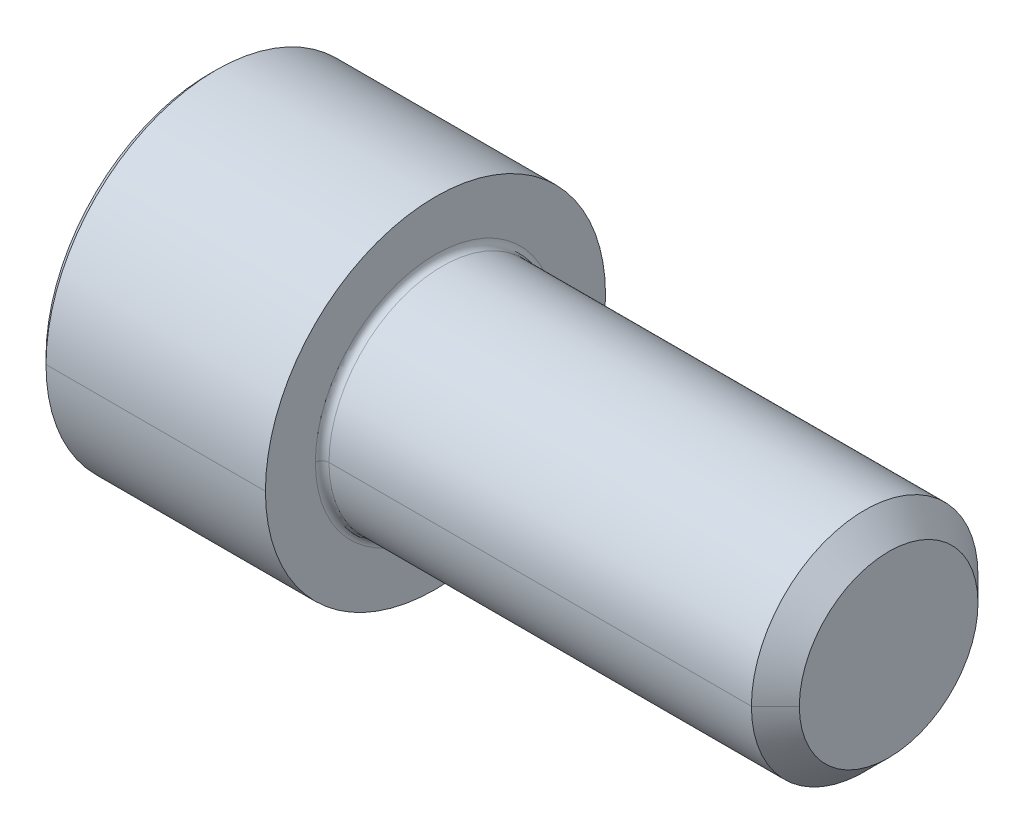
ISO-10303-21;
HEADER;
FILE_DESCRIPTION(('STEP AP214'),'2;1');
FILE_NAME('part.step','',(''),(''),'','','');
FILE_SCHEMA(('AUTOMOTIVE_DESIGN { 1 0 10303 214 1 1 1 1 }'));
ENDSEC;
DATA;
#1=APPLICATION_CONTEXT('core data for automotive mechanical design processes');
#2=APPLICATION_PROTOCOL_DEFINITION('international standard','automotive_design',2000,#1);
#3=PRODUCT_CONTEXT('',#1,'mechanical');
#4=PRODUCT('Part','Part','',(#3));
#5=PRODUCT_RELATED_PRODUCT_CATEGORY('part','',(#4));
#6=PRODUCT_DEFINITION_FORMATION('','',#4);
#7=PRODUCT_DEFINITION_CONTEXT('part definition',#1,'design');
#8=PRODUCT_DEFINITION('design','',#6,#7);
#9=PRODUCT_DEFINITION_SHAPE('','',#8);
#10=(LENGTH_UNIT() NAMED_UNIT(*) SI_UNIT(.MILLI.,.METRE.));
#11=(NAMED_UNIT(*) PLANE_ANGLE_UNIT() SI_UNIT($,.RADIAN.));
#12=(NAMED_UNIT(*) SI_UNIT($,.STERADIAN.) SOLID_ANGLE_UNIT());
#13=UNCERTAINTY_MEASURE_WITH_UNIT(LENGTH_MEASURE(1.E-05),#10,'distance_accuracy_value','');
#14=(GEOMETRIC_REPRESENTATION_CONTEXT(3) GLOBAL_UNCERTAINTY_ASSIGNED_CONTEXT((#13)) GLOBAL_UNIT_ASSIGNED_CONTEXT((#10,
#11,#12)) REPRESENTATION_CONTEXT('',''));
#15=CARTESIAN_POINT('',(0.,0.,0.));
#16=DIRECTION('',(0.,0.,1.));
#17=DIRECTION('',(1.,0.,0.));
#18=AXIS2_PLACEMENT_3D('',#15,#16,#17);
#19=CARTESIAN_POINT('',(-4.0894,0.,0.));
#20=DIRECTION('',(-1.,0.,0.));
#21=DIRECTION('',(0.,1.,0.));
#22=AXIS2_PLACEMENT_3D('',#19,#20,#21);
#23=CONICAL_SURFACE('',#22,3.175,1.04719755119659);
#24=CARTESIAN_POINT('',(-2.25631289532291,0.,0.));
#25=DIRECTION('',(-0.500000000000007,0.,-0.866025403784435));
#26=VECTOR('',#25,1.);
#27=LINE('',#24,#26);
#28=CARTESIAN_POINT('',(-2.2563128953229,0.,0.));
#29=VERTEX_POINT('',#28);
#30=CARTESIAN_POINT('',(-4.0894,0.,-3.175));
#31=VERTEX_POINT('',#30);
#32=EDGE_CURVE('E11',#29,#31,#27,.T.);
#33=ORIENTED_EDGE('',*,*,#32,.T.);
#34=CARTESIAN_POINT('',(-4.0894,0.,0.));
#35=DIRECTION('',(1.,0.,0.));
#36=DIRECTION('',(0.,0.,-1.));
#37=AXIS2_PLACEMENT_3D('',#34,#35,#36);
#38=CIRCLE('',#37,3.175);
#39=CARTESIAN_POINT('',(-4.0894,-2.74963065701562,-1.58749999999996));
#40=VERTEX_POINT('',#39);
#41=EDGE_CURVE('E25',#40,#31,#38,.T.);
#42=ORIENTED_EDGE('',*,*,#41,.F.);
#43=CARTESIAN_POINT('',(-4.0894,0.,0.));
#44=DIRECTION('',(1.,0.,0.));
#45=DIRECTION('',(0.,0.,-1.));
#46=AXIS2_PLACEMENT_3D('',#43,#44,#45);
#47=CIRCLE('',#46,3.175);
#48=CARTESIAN_POINT('',(-4.0894,-2.74963065701562,1.58749999999996));
#49=VERTEX_POINT('',#48);
#50=EDGE_CURVE('E604',#49,#40,#47,.T.);
#51=ORIENTED_EDGE('',*,*,#50,.F.);
#52=CARTESIAN_POINT('',(-4.0894,0.,0.));
#53=DIRECTION('',(1.,0.,0.));
#54=DIRECTION('',(0.,0.,-1.));
#55=AXIS2_PLACEMENT_3D('',#52,#53,#54);
#56=CIRCLE('',#55,3.175);
#57=CARTESIAN_POINT('',(-4.0894,0.,3.175));
#58=VERTEX_POINT('',#57);
#59=EDGE_CURVE('E601',#58,#49,#56,.T.);
#60=ORIENTED_EDGE('',*,*,#59,.F.);
#61=CARTESIAN_POINT('',(-2.25631289532291,0.,0.));
#62=DIRECTION('',(-0.500000000000007,0.,0.866025403784435));
#63=VECTOR('',#62,1.);
#64=LINE('',#61,#63);
#65=EDGE_CURVE('E591',#29,#58,#64,.T.);
#66=ORIENTED_EDGE('',*,*,#65,.F.);
#67=EDGE_LOOP('',(#33,#42,#51,#60,#66));
#68=FACE_BOUND('',#67,.T.);
#69=ADVANCED_FACE('F17',(#68),#23,.F.);
#70=CARTESIAN_POINT('',(-4.0894,0.,0.));
#71=DIRECTION('',(-1.,0.,0.));
#72=DIRECTION('',(0.,-1.,0.));
#73=AXIS2_PLACEMENT_3D('',#70,#71,#72);
#74=CONICAL_SURFACE('',#73,3.175,1.04719755119659);
#75=ORIENTED_EDGE('',*,*,#65,.T.);
#76=CARTESIAN_POINT('',(-4.0894,0.,0.));
#77=DIRECTION('',(1.,0.,0.));
#78=DIRECTION('',(0.,0.,-1.));
#79=AXIS2_PLACEMENT_3D('',#76,#77,#78);
#80=CIRCLE('',#79,3.175);
#81=CARTESIAN_POINT('',(-4.0894,2.74963065701562,1.58749999999996));
#82=VERTEX_POINT('',#81);
#83=EDGE_CURVE('E643',#82,#58,#80,.T.);
#84=ORIENTED_EDGE('',*,*,#83,.F.);
#85=CARTESIAN_POINT('',(-4.0894,0.,0.));
#86=DIRECTION('',(1.,0.,0.));
#87=DIRECTION('',(0.,0.,-1.));
#88=AXIS2_PLACEMENT_3D('',#85,#86,#87);
#89=CIRCLE('',#88,3.175);
#90=CARTESIAN_POINT('',(-4.0894,2.74963065701562,-1.58749999999996));
#91=VERTEX_POINT('',#90);
#92=EDGE_CURVE('E646',#91,#82,#89,.T.);
#93=ORIENTED_EDGE('',*,*,#92,.F.);
#94=CARTESIAN_POINT('',(-4.0894,0.,0.));
#95=DIRECTION('',(1.,0.,0.));
#96=DIRECTION('',(0.,0.,-1.));
#97=AXIS2_PLACEMENT_3D('',#94,#95,#96);
#98=CIRCLE('',#97,3.175);
#99=EDGE_CURVE('E557',#31,#91,#98,.T.);
#100=ORIENTED_EDGE('',*,*,#99,.F.);
#101=ORIENTED_EDGE('',*,*,#32,.F.);
#102=EDGE_LOOP('',(#75,#84,#93,#100,#101));
#103=FACE_BOUND('',#102,.T.);
#104=ADVANCED_FACE('F564',(#103),#74,.F.);
#105=CARTESIAN_POINT('',(-4.0894,0.,0.));
#106=DIRECTION('',(1.,0.,0.));
#107=DIRECTION('',(0.,0.,-1.));
#108=AXIS2_PLACEMENT_3D('',#105,#106,#107);
#109=PLANE('',#108);
#110=ORIENTED_EDGE('',*,*,#99,.T.);
#111=DIRECTION('',(0.,0.499999999999987,0.866025403784446));
#112=VECTOR('',#111,1.);
#113=CARTESIAN_POINT('',(-4.0894,1.8330871046771,-3.175));
#114=LINE('',#113,#112);
#115=CARTESIAN_POINT('',(-4.0894,1.8330871046771,-3.175));
#116=VERTEX_POINT('',#115);
#117=EDGE_CURVE('E552',#116,#91,#114,.T.);
#118=ORIENTED_EDGE('',*,*,#117,.F.);
#119=DIRECTION('',(0.,1.,0.));
#120=VECTOR('',#119,1.);
#121=CARTESIAN_POINT('',(-4.0894,-1.8330871046771,-3.175));
#122=LINE('',#121,#120);
#123=EDGE_CURVE('E547',#31,#116,#122,.T.);
#124=ORIENTED_EDGE('',*,*,#123,.F.);
#125=EDGE_LOOP('',(#110,#118,#124));
#126=FACE_BOUND('',#125,.T.);
#127=ADVANCED_FACE('F573',(#126),#109,.F.);
#128=CARTESIAN_POINT('',(-4.0894,-1.8330871046771,-3.175));
#129=DIRECTION('',(0.,0.,1.));
#130=DIRECTION('',(1.,0.,0.));
#131=AXIS2_PLACEMENT_3D('',#128,#129,#130);
#132=PLANE('',#131);
#133=DIRECTION('',(0.,1.,0.));
#134=VECTOR('',#133,1.);
#135=CARTESIAN_POINT('',(-7.9248,-1.8330871046771,-3.175));
#136=LINE('',#135,#134);
#137=CARTESIAN_POINT('',(-7.9248,-1.8330871046771,-3.175));
#138=VERTEX_POINT('',#137);
#139=CARTESIAN_POINT('',(-7.9248,1.8330871046771,-3.175));
#140=VERTEX_POINT('',#139);
#141=EDGE_CURVE('E542',#138,#140,#136,.T.);
#142=ORIENTED_EDGE('',*,*,#141,.F.);
#143=DIRECTION('',(-1.,0.,0.));
#144=VECTOR('',#143,1.);
#145=CARTESIAN_POINT('',(-4.0894,-1.8330871046771,-3.175));
#146=LINE('',#145,#144);
#147=CARTESIAN_POINT('',(-4.0894,-1.8330871046771,-3.175));
#148=VERTEX_POINT('',#147);
#149=EDGE_CURVE('E537',#148,#138,#146,.T.);
#150=ORIENTED_EDGE('',*,*,#149,.F.);
#151=DIRECTION('',(0.,1.,0.));
#152=VECTOR('',#151,1.);
#153=CARTESIAN_POINT('',(-4.0894,-1.8330871046771,-3.175));
#154=LINE('',#153,#152);
#155=EDGE_CURVE('E532',#148,#31,#154,.T.);
#156=ORIENTED_EDGE('',*,*,#155,.T.);
#157=ORIENTED_EDGE('',*,*,#123,.T.);
#158=DIRECTION('',(-1.,0.,0.));
#159=VECTOR('',#158,1.);
#160=CARTESIAN_POINT('',(-4.0894,1.8330871046771,-3.175));
#161=LINE('',#160,#159);
#162=EDGE_CURVE('E528',#116,#140,#161,.T.);
#163=ORIENTED_EDGE('',*,*,#162,.T.);
#164=EDGE_LOOP('',(#142,#150,#156,#157,#163));
#165=FACE_BOUND('',#164,.T.);
#166=ADVANCED_FACE('F672',(#165),#132,.T.);
#167=CARTESIAN_POINT('',(-4.0894,1.8330871046771,-3.175));
#168=DIRECTION('',(0.,-0.866025403784446,0.499999999999987));
#169=DIRECTION('',(0.,-0.499999999999987,-0.866025403784446));
#170=AXIS2_PLACEMENT_3D('',#167,#168,#169);
#171=PLANE('',#170);
#172=DIRECTION('',(0.,0.499999999999987,0.866025403784446));
#173=VECTOR('',#172,1.);
#174=CARTESIAN_POINT('',(-7.9248,1.8330871046771,-3.175));
#175=LINE('',#174,#173);
#176=CARTESIAN_POINT('',(-7.9248,3.66617420935411,0.));
#177=VERTEX_POINT('',#176);
#178=EDGE_CURVE('E523',#140,#177,#175,.T.);
#179=ORIENTED_EDGE('',*,*,#178,.F.);
#180=ORIENTED_EDGE('',*,*,#162,.F.);
#181=ORIENTED_EDGE('',*,*,#117,.T.);
#182=DIRECTION('',(0.,0.499999999999987,0.866025403784446));
#183=VECTOR('',#182,1.);
#184=CARTESIAN_POINT('',(-4.0894,1.8330871046771,-3.175));
#185=LINE('',#184,#183);
#186=CARTESIAN_POINT('',(-4.0894,3.66617420935411,0.));
#187=VERTEX_POINT('',#186);
#188=EDGE_CURVE('E519',#91,#187,#185,.T.);
#189=ORIENTED_EDGE('',*,*,#188,.T.);
#190=DIRECTION('',(-1.,0.,0.));
#191=VECTOR('',#190,1.);
#192=CARTESIAN_POINT('',(-4.0894,3.66617420935411,0.));
#193=LINE('',#192,#191);
#194=EDGE_CURVE('E515',#187,#177,#193,.T.);
#195=ORIENTED_EDGE('',*,*,#194,.T.);
#196=EDGE_LOOP('',(#179,#180,#181,#189,#195));
#197=FACE_BOUND('',#196,.T.);
#198=ADVANCED_FACE('F659',(#197),#171,.T.);
#199=CARTESIAN_POINT('',(-4.0894,3.66617420935411,0.));
#200=DIRECTION('',(0.,-0.866025403784446,-0.499999999999987));
#201=DIRECTION('',(0.,0.499999999999987,-0.866025403784446));
#202=AXIS2_PLACEMENT_3D('',#199,#200,#201);
#203=PLANE('',#202);
#204=DIRECTION('',(0.,-0.499999999999987,0.866025403784446));
#205=VECTOR('',#204,1.);
#206=CARTESIAN_POINT('',(-7.9248,3.66617420935411,0.));
#207=LINE('',#206,#205);
#208=CARTESIAN_POINT('',(-7.9248,1.8330871046771,3.175));
#209=VERTEX_POINT('',#208);
#210=EDGE_CURVE('E510',#177,#209,#207,.T.);
#211=ORIENTED_EDGE('',*,*,#210,.F.);
#212=ORIENTED_EDGE('',*,*,#194,.F.);
#213=DIRECTION('',(0.,-0.499999999999987,0.866025403784446));
#214=VECTOR('',#213,1.);
#215=CARTESIAN_POINT('',(-4.0894,3.66617420935411,0.));
#216=LINE('',#215,#214);
#217=EDGE_CURVE('E505',#187,#82,#216,.T.);
#218=ORIENTED_EDGE('',*,*,#217,.T.);
#219=DIRECTION('',(0.,-0.499999999999987,0.866025403784446));
#220=VECTOR('',#219,1.);
#221=CARTESIAN_POINT('',(-4.0894,3.66617420935411,0.));
#222=LINE('',#221,#220);
#223=CARTESIAN_POINT('',(-4.0894,1.8330871046771,3.175));
#224=VERTEX_POINT('',#223);
#225=EDGE_CURVE('E501',#82,#224,#222,.T.);
#226=ORIENTED_EDGE('',*,*,#225,.T.);
#227=DIRECTION('',(-1.,0.,0.));
#228=VECTOR('',#227,1.);
#229=CARTESIAN_POINT('',(-4.0894,1.8330871046771,3.175));
#230=LINE('',#229,#228);
#231=EDGE_CURVE('E497',#224,#209,#230,.T.);
#232=ORIENTED_EDGE('',*,*,#231,.T.);
#233=EDGE_LOOP('',(#211,#212,#218,#226,#232));
#234=FACE_BOUND('',#233,.T.);
#235=ADVANCED_FACE('F666',(#234),#203,.T.);
#236=CARTESIAN_POINT('',(-4.0894,1.8330871046771,3.175));
#237=DIRECTION('',(0.,0.,-1.));
#238=DIRECTION('',(-1.,0.,0.));
#239=AXIS2_PLACEMENT_3D('',#236,#237,#238);
#240=PLANE('',#239);
#241=DIRECTION('',(0.,-1.,0.));
#242=VECTOR('',#241,1.);
#243=CARTESIAN_POINT('',(-7.9248,1.8330871046771,3.175));
#244=LINE('',#243,#242);
#245=CARTESIAN_POINT('',(-7.9248,-1.8330871046771,3.175));
#246=VERTEX_POINT('',#245);
#247=EDGE_CURVE('E492',#209,#246,#244,.T.);
#248=ORIENTED_EDGE('',*,*,#247,.F.);
#249=ORIENTED_EDGE('',*,*,#231,.F.);
#250=DIRECTION('',(0.,-1.,0.));
#251=VECTOR('',#250,1.);
#252=CARTESIAN_POINT('',(-4.0894,1.8330871046771,3.175));
#253=LINE('',#252,#251);
#254=EDGE_CURVE('E487',#224,#58,#253,.T.);
#255=ORIENTED_EDGE('',*,*,#254,.T.);
#256=DIRECTION('',(0.,-1.,0.));
#257=VECTOR('',#256,1.);
#258=CARTESIAN_POINT('',(-4.0894,1.8330871046771,3.175));
#259=LINE('',#258,#257);
#260=CARTESIAN_POINT('',(-4.0894,-1.8330871046771,3.175));
#261=VERTEX_POINT('',#260);
#262=EDGE_CURVE('E483',#58,#261,#259,.T.);
#263=ORIENTED_EDGE('',*,*,#262,.T.);
#264=DIRECTION('',(-1.,0.,0.));
#265=VECTOR('',#264,1.);
#266=CARTESIAN_POINT('',(-4.0894,-1.8330871046771,3.175));
#267=LINE('',#266,#265);
#268=EDGE_CURVE('E479',#261,#246,#267,.T.);
#269=ORIENTED_EDGE('',*,*,#268,.T.);
#270=EDGE_LOOP('',(#248,#249,#255,#263,#269));
#271=FACE_BOUND('',#270,.T.);
#272=ADVANCED_FACE('F675',(#271),#240,.T.);
#273=CARTESIAN_POINT('',(-4.0894,-1.8330871046771,3.175));
#274=DIRECTION('',(0.,0.866025403784446,-0.499999999999987));
#275=DIRECTION('',(0.,0.499999999999987,0.866025403784446));
#276=AXIS2_PLACEMENT_3D('',#273,#274,#275);
#277=PLANE('',#276);
#278=DIRECTION('',(0.,-0.499999999999987,-0.866025403784446));
#279=VECTOR('',#278,1.);
#280=CARTESIAN_POINT('',(-7.9248,-1.8330871046771,3.175));
#281=LINE('',#280,#279);
#282=CARTESIAN_POINT('',(-7.9248,-3.66617420935411,0.));
#283=VERTEX_POINT('',#282);
#284=EDGE_CURVE('E474',#246,#283,#281,.T.);
#285=ORIENTED_EDGE('',*,*,#284,.F.);
#286=ORIENTED_EDGE('',*,*,#268,.F.);
#287=DIRECTION('',(0.,-0.499999999999987,-0.866025403784446));
#288=VECTOR('',#287,1.);
#289=CARTESIAN_POINT('',(-4.0894,-1.8330871046771,3.175));
#290=LINE('',#289,#288);
#291=EDGE_CURVE('E469',#261,#49,#290,.T.);
#292=ORIENTED_EDGE('',*,*,#291,.T.);
#293=DIRECTION('',(0.,-0.499999999999987,-0.866025403784446));
#294=VECTOR('',#293,1.);
#295=CARTESIAN_POINT('',(-4.0894,-1.8330871046771,3.175));
#296=LINE('',#295,#294);
#297=CARTESIAN_POINT('',(-4.0894,-3.66617420935411,0.));
#298=VERTEX_POINT('',#297);
#299=EDGE_CURVE('E465',#49,#298,#296,.T.);
#300=ORIENTED_EDGE('',*,*,#299,.T.);
#301=DIRECTION('',(-1.,0.,0.));
#302=VECTOR('',#301,1.);
#303=CARTESIAN_POINT('',(-4.0894,-3.66617420935411,0.));
#304=LINE('',#303,#302);
#305=EDGE_CURVE('E461',#298,#283,#304,.T.);
#306=ORIENTED_EDGE('',*,*,#305,.T.);
#307=EDGE_LOOP('',(#285,#286,#292,#300,#306));
#308=FACE_BOUND('',#307,.T.);
#309=ADVANCED_FACE('F633',(#308),#277,.T.);
#310=CARTESIAN_POINT('',(-4.0894,-3.66617420935411,0.));
#311=DIRECTION('',(0.,0.866025403784446,0.499999999999987));
#312=DIRECTION('',(0.,-0.499999999999987,0.866025403784446));
#313=AXIS2_PLACEMENT_3D('',#310,#311,#312);
#314=PLANE('',#313);
#315=DIRECTION('',(0.,0.499999999999987,-0.866025403784446));
#316=VECTOR('',#315,1.);
#317=CARTESIAN_POINT('',(-7.9248,-3.66617420935411,0.));
#318=LINE('',#317,#316);
#319=EDGE_CURVE('E456',#283,#138,#318,.T.);
#320=ORIENTED_EDGE('',*,*,#319,.F.);
#321=ORIENTED_EDGE('',*,*,#305,.F.);
#322=DIRECTION('',(0.,0.499999999999987,-0.866025403784446));
#323=VECTOR('',#322,1.);
#324=CARTESIAN_POINT('',(-4.0894,-3.66617420935411,0.));
#325=LINE('',#324,#323);
#326=EDGE_CURVE('E452',#298,#40,#325,.T.);
#327=ORIENTED_EDGE('',*,*,#326,.T.);
#328=DIRECTION('',(0.,0.499999999999987,-0.866025403784446));
#329=VECTOR('',#328,1.);
#330=CARTESIAN_POINT('',(-4.0894,-3.66617420935411,0.));
#331=LINE('',#330,#329);
#332=EDGE_CURVE('E447',#40,#148,#331,.T.);
#333=ORIENTED_EDGE('',*,*,#332,.T.);
#334=ORIENTED_EDGE('',*,*,#149,.T.);
#335=EDGE_LOOP('',(#320,#321,#327,#333,#334));
#336=FACE_BOUND('',#335,.T.);
#337=ADVANCED_FACE('F673',(#336),#314,.T.);
#338=CARTESIAN_POINT('',(-4.0894,0.,0.));
#339=DIRECTION('',(1.,0.,0.));
#340=DIRECTION('',(0.,0.,-1.));
#341=AXIS2_PLACEMENT_3D('',#338,#339,#340);
#342=PLANE('',#341);
#343=ORIENTED_EDGE('',*,*,#41,.T.);
#344=ORIENTED_EDGE('',*,*,#155,.F.);
#345=ORIENTED_EDGE('',*,*,#332,.F.);
#346=EDGE_LOOP('',(#343,#344,#345));
#347=FACE_BOUND('',#346,.T.);
#348=ADVANCED_FACE('F623',(#347),#342,.F.);
#349=CARTESIAN_POINT('',(-4.0894,0.,0.));
#350=DIRECTION('',(1.,0.,0.));
#351=DIRECTION('',(0.,0.,-1.));
#352=AXIS2_PLACEMENT_3D('',#349,#350,#351);
#353=PLANE('',#352);
#354=ORIENTED_EDGE('',*,*,#50,.T.);
#355=ORIENTED_EDGE('',*,*,#326,.F.);
#356=ORIENTED_EDGE('',*,*,#299,.F.);
#357=EDGE_LOOP('',(#354,#355,#356));
#358=FACE_BOUND('',#357,.T.);
#359=ADVANCED_FACE('F628',(#358),#353,.F.);
#360=CARTESIAN_POINT('',(-7.9248,0.,0.));
#361=DIRECTION('',(1.,0.,0.));
#362=DIRECTION('',(0.,0.,-1.));
#363=AXIS2_PLACEMENT_3D('',#360,#361,#362);
#364=PLANE('',#363);
#365=CARTESIAN_POINT('',(-7.9248,0.,0.));
#366=DIRECTION('',(1.,0.,0.));
#367=DIRECTION('',(0.,0.,-1.));
#368=AXIS2_PLACEMENT_3D('',#365,#366,#367);
#369=CIRCLE('',#368,5.718048);
#370=CARTESIAN_POINT('',(-7.9248,0.,-5.718048));
#371=VERTEX_POINT('',#370);
#372=CARTESIAN_POINT('',(-7.9248,0.,5.718048));
#373=VERTEX_POINT('',#372);
#374=EDGE_CURVE('E443',#371,#373,#369,.T.);
#375=ORIENTED_EDGE('',*,*,#374,.F.);
#376=CARTESIAN_POINT('',(-7.9248,0.,0.));
#377=DIRECTION('',(1.,0.,0.));
#378=DIRECTION('',(0.,0.,-1.));
#379=AXIS2_PLACEMENT_3D('',#376,#377,#378);
#380=CIRCLE('',#379,5.718048);
#381=EDGE_CURVE('E441',#373,#371,#380,.T.);
#382=ORIENTED_EDGE('',*,*,#381,.F.);
#383=EDGE_LOOP('',(#375,#382));
#384=FACE_BOUND('',#383,.T.);
#385=ORIENTED_EDGE('',*,*,#247,.T.);
#386=ORIENTED_EDGE('',*,*,#284,.T.);
#387=ORIENTED_EDGE('',*,*,#319,.T.);
#388=ORIENTED_EDGE('',*,*,#141,.T.);
#389=ORIENTED_EDGE('',*,*,#178,.T.);
#390=ORIENTED_EDGE('',*,*,#210,.T.);
#391=EDGE_LOOP('',(#385,#386,#387,#388,#389,#390));
#392=FACE_BOUND('',#391,.T.);
#393=ADVANCED_FACE('F669',(#384,#392),#364,.F.);
#394=CARTESIAN_POINT('',(-7.9248,0.,0.));
#395=DIRECTION('',(1.,0.,0.));
#396=DIRECTION('',(0.,1.,0.));
#397=AXIS2_PLACEMENT_3D('',#394,#395,#396);
#398=CONICAL_SURFACE('',#397,5.718048,0.785398163397445);
#399=ORIENTED_EDGE('',*,*,#381,.T.);
#400=CARTESIAN_POINT('',(-7.9248,0.,-5.718048));
#401=DIRECTION('',(0.70710678118655,0.,-0.707106781186545));
#402=VECTOR('',#401,1.);
#403=LINE('',#400,#402);
#404=CARTESIAN_POINT('',(-7.686548,0.,-5.9563));
#405=VERTEX_POINT('',#404);
#406=EDGE_CURVE('E411',#371,#405,#403,.T.);
#407=ORIENTED_EDGE('',*,*,#406,.T.);
#408=CARTESIAN_POINT('',(-7.686548,0.,0.));
#409=DIRECTION('',(1.,0.,0.));
#410=DIRECTION('',(0.,0.,-1.));
#411=AXIS2_PLACEMENT_3D('',#408,#409,#410);
#412=CIRCLE('',#411,5.9563);
#413=CARTESIAN_POINT('',(-7.686548,0.,5.9563));
#414=VERTEX_POINT('',#413);
#415=EDGE_CURVE('E428',#414,#405,#412,.T.);
#416=ORIENTED_EDGE('',*,*,#415,.F.);
#417=CARTESIAN_POINT('',(-7.9248,0.,5.718048));
#418=DIRECTION('',(0.70710678118655,0.,0.707106781186545));
#419=VECTOR('',#418,1.);
#420=LINE('',#417,#419);
#421=EDGE_CURVE('E413',#373,#414,#420,.T.);
#422=ORIENTED_EDGE('',*,*,#421,.F.);
#423=EDGE_LOOP('',(#399,#407,#416,#422));
#424=FACE_BOUND('',#423,.T.);
#425=ADVANCED_FACE('F394',(#424),#398,.T.);
#426=CARTESIAN_POINT('',(-7.9248,0.,0.));
#427=DIRECTION('',(1.,0.,0.));
#428=DIRECTION('',(0.,-1.,0.));
#429=AXIS2_PLACEMENT_3D('',#426,#427,#428);
#430=CONICAL_SURFACE('',#429,5.718048,0.785398163397445);
#431=CARTESIAN_POINT('',(-7.686548,0.,0.));
#432=DIRECTION('',(1.,0.,0.));
#433=DIRECTION('',(0.,0.,-1.));
#434=AXIS2_PLACEMENT_3D('',#431,#432,#433);
#435=CIRCLE('',#434,5.9563);
#436=EDGE_CURVE('E377',#405,#414,#435,.T.);
#437=ORIENTED_EDGE('',*,*,#436,.F.);
#438=ORIENTED_EDGE('',*,*,#406,.F.);
#439=ORIENTED_EDGE('',*,*,#374,.T.);
#440=ORIENTED_EDGE('',*,*,#421,.T.);
#441=EDGE_LOOP('',(#437,#438,#439,#440));
#442=FACE_BOUND('',#441,.T.);
#443=ADVANCED_FACE('F385',(#442),#430,.T.);
#444=CARTESIAN_POINT('',(15.875,0.,0.));
#445=DIRECTION('',(-1.,0.,0.));
#446=DIRECTION('',(0.,-1.,0.));
#447=AXIS2_PLACEMENT_3D('',#444,#445,#446);
#448=CYLINDRICAL_SURFACE('',#447,5.9563);
#449=CARTESIAN_POINT('',(0.,0.,0.));
#450=DIRECTION('',(1.,0.,0.));
#451=DIRECTION('',(0.,0.,-1.));
#452=AXIS2_PLACEMENT_3D('',#449,#450,#451);
#453=CIRCLE('',#452,5.9563);
#454=CARTESIAN_POINT('',(0.,0.,-5.9563));
#455=VERTEX_POINT('',#454);
#456=CARTESIAN_POINT('',(0.,0.,5.9563));
#457=VERTEX_POINT('',#456);
#458=EDGE_CURVE('E374',#455,#457,#453,.T.);
#459=ORIENTED_EDGE('',*,*,#458,.F.);
#460=CARTESIAN_POINT('',(0.,0.,-5.9563));
#461=DIRECTION('',(-1.,0.,0.));
#462=VECTOR('',#461,1.);
#463=LINE('',#460,#462);
#464=EDGE_CURVE('E351',#455,#405,#463,.T.);
#465=ORIENTED_EDGE('',*,*,#464,.T.);
#466=ORIENTED_EDGE('',*,*,#436,.T.);
#467=CARTESIAN_POINT('',(0.,0.,5.9563));
#468=DIRECTION('',(-1.,0.,0.));
#469=VECTOR('',#468,1.);
#470=LINE('',#467,#469);
#471=EDGE_CURVE('E364',#457,#414,#470,.T.);
#472=ORIENTED_EDGE('',*,*,#471,.F.);
#473=EDGE_LOOP('',(#459,#465,#466,#472));
#474=FACE_BOUND('',#473,.T.);
#475=ADVANCED_FACE('F330',(#474),#448,.T.);
#476=CARTESIAN_POINT('',(15.875,0.,0.));
#477=DIRECTION('',(-1.,0.,0.));
#478=DIRECTION('',(0.,1.,0.));
#479=AXIS2_PLACEMENT_3D('',#476,#477,#478);
#480=CYLINDRICAL_SURFACE('',#479,5.9563);
#481=ORIENTED_EDGE('',*,*,#415,.T.);
#482=ORIENTED_EDGE('',*,*,#464,.F.);
#483=CARTESIAN_POINT('',(0.,0.,0.));
#484=DIRECTION('',(1.,0.,0.));
#485=DIRECTION('',(0.,0.,-1.));
#486=AXIS2_PLACEMENT_3D('',#483,#484,#485);
#487=CIRCLE('',#486,5.9563);
#488=EDGE_CURVE('E313',#457,#455,#487,.T.);
#489=ORIENTED_EDGE('',*,*,#488,.F.);
#490=ORIENTED_EDGE('',*,*,#471,.T.);
#491=EDGE_LOOP('',(#481,#482,#489,#490));
#492=FACE_BOUND('',#491,.T.);
#493=ADVANCED_FACE('F321',(#492),#480,.T.);
#494=CARTESIAN_POINT('',(0.,5.9563,0.));
#495=DIRECTION('',(-1.,0.,0.));
#496=DIRECTION('',(0.,0.,1.));
#497=AXIS2_PLACEMENT_3D('',#494,#495,#496);
#498=PLANE('',#497);
#499=CARTESIAN_POINT('',(0.,0.,0.));
#500=DIRECTION('',(1.,0.,0.));
#501=DIRECTION('',(0.,0.,-1.));
#502=AXIS2_PLACEMENT_3D('',#499,#500,#501);
#503=CIRCLE('',#502,4.207002);
#504=CARTESIAN_POINT('',(0.,0.,-4.207002));
#505=VERTEX_POINT('',#504);
#506=CARTESIAN_POINT('',(0.,0.,4.207002));
#507=VERTEX_POINT('',#506);
#508=EDGE_CURVE('E309',#505,#507,#503,.T.);
#509=ORIENTED_EDGE('',*,*,#508,.F.);
#510=CARTESIAN_POINT('',(0.,0.,0.));
#511=DIRECTION('',(1.,0.,0.));
#512=DIRECTION('',(0.,0.,-1.));
#513=AXIS2_PLACEMENT_3D('',#510,#511,#512);
#514=CIRCLE('',#513,4.207002);
#515=EDGE_CURVE('E305',#507,#505,#514,.T.);
#516=ORIENTED_EDGE('',*,*,#515,.F.);
#517=EDGE_LOOP('',(#509,#516));
#518=FACE_BOUND('',#517,.T.);
#519=ORIENTED_EDGE('',*,*,#458,.T.);
#520=ORIENTED_EDGE('',*,*,#488,.T.);
#521=EDGE_LOOP('',(#519,#520));
#522=FACE_BOUND('',#521,.T.);
#523=ADVANCED_FACE('F289',(#518,#522),#498,.F.);
#524=CARTESIAN_POINT('',(0.238251999999928,0.,0.));
#525=DIRECTION('',(1.,0.,0.));
#526=DIRECTION('',(0.,1.,0.));
#527=AXIS2_PLACEMENT_3D('',#524,#525,#526);
#528=TOROIDAL_SURFACE('',#527,4.20700199999992,0.238251999999928);
#529=CARTESIAN_POINT('',(0.238251999999928,0.,0.));
#530=DIRECTION('',(1.,0.,0.));
#531=DIRECTION('',(0.,0.,-1.));
#532=AXIS2_PLACEMENT_3D('',#529,#530,#531);
#533=CIRCLE('',#532,3.96875);
#534=CARTESIAN_POINT('',(0.238251999999928,0.,3.96875));
#535=VERTEX_POINT('',#534);
#536=CARTESIAN_POINT('',(0.238251999999928,0.,-3.96875));
#537=VERTEX_POINT('',#536);
#538=EDGE_CURVE('E303',#535,#537,#533,.T.);
#539=ORIENTED_EDGE('',*,*,#538,.F.);
#540=CARTESIAN_POINT('',(0.238251999999929,0.,3.96875));
#541=CARTESIAN_POINT('',(0.234353606829316,0.,3.9687499173054));
#542=CARTESIAN_POINT('',(0.230455220695202,0.,3.96884567792309));
#543=CARTESIAN_POINT('',(0.222667836216946,0.,3.96922829201331));
#544=CARTESIAN_POINT('',(0.218778837872804,0.,3.96951514548583));
#545=CARTESIAN_POINT('',(0.211019602691462,0.,3.97027935151595));
#546=CARTESIAN_POINT('',(0.207149365854263,0.,3.97075670407356));
#547=CARTESIAN_POINT('',(0.199436976145725,0.,3.97190073222218));
#548=CARTESIAN_POINT('',(0.195594823274386,0.,3.9725674078132));
#549=CARTESIAN_POINT('',(0.187947857923509,0.,3.97408848293354));
#550=CARTESIAN_POINT('',(0.18414304544397,0.,3.97494288246285));
#551=CARTESIAN_POINT('',(0.176579926911275,0.,3.97683734526493));
#552=CARTESIAN_POINT('',(0.172821620858118,0.,3.97787740853768));
#553=CARTESIAN_POINT('',(0.165360569291294,0.,3.98014069372458));
#554=CARTESIAN_POINT('',(0.161657823777626,0.,3.98136391563872));
#555=CARTESIAN_POINT('',(0.154316813521443,0.,3.9839905711253));
#556=CARTESIAN_POINT('',(0.150678548778927,0.,3.98539400469774));
#557=CARTESIAN_POINT('',(0.143475264965256,0.,3.9883777025425));
#558=CARTESIAN_POINT('',(0.139910245894101,0.,3.98995796681483));
#559=CARTESIAN_POINT('',(0.132862041865877,0.,3.99329151905468));
#560=CARTESIAN_POINT('',(0.129378856908809,0.,3.9950448070222));
#561=CARTESIAN_POINT('',(0.122502712406539,0.,3.99872018283075));
#562=CARTESIAN_POINT('',(0.119109752861338,0.,4.00064227067177));
#563=CARTESIAN_POINT('',(0.112422233119501,0.,4.00465061574866));
#564=CARTESIAN_POINT('',(0.109127672922866,0.,4.00673687298452));
#565=CARTESIAN_POINT('',(0.102644888762252,0.,4.01106853087486));
#566=CARTESIAN_POINT('',(0.0994566647982736,0.,4.01331393152934));
#567=CARTESIAN_POINT('',(0.0931942338137572,0.,4.01795846689001));
#568=CARTESIAN_POINT('',(0.0901200267932191,0.,4.02035760159619));
#569=CARTESIAN_POINT('',(0.0840930357295644,0.,4.02530382533465));
#570=CARTESIAN_POINT('',(0.0811402516864478,0.,4.02785091436692));
#571=CARTESIAN_POINT('',(0.0753632200930295,0.,4.03308691059695));
#572=CARTESIAN_POINT('',(0.0725389725427276,0.,4.03577581779471));
#573=CARTESIAN_POINT('',(0.0670258177946627,0.,4.04128897254278));
#574=CARTESIAN_POINT('',(0.0643369105968996,0.,4.04411322009308));
#575=CARTESIAN_POINT('',(0.0591009143668706,0.,4.0498902516865));
#576=CARTESIAN_POINT('',(0.0565538253346046,0.,4.05284303572962));
#577=CARTESIAN_POINT('',(0.0516076015961515,0.,4.05887002679327));
#578=CARTESIAN_POINT('',(0.0492084668899643,0.,4.06194423381381));
#579=CARTESIAN_POINT('',(0.0445639315293013,0.,4.06820666479833));
#580=CARTESIAN_POINT('',(0.0423185308748255,0.,4.07139488876231));
#581=CARTESIAN_POINT('',(0.037986872984486,0.,4.07787767292292));
#582=CARTESIAN_POINT('',(0.0359006157486223,0.,4.08117223311956));
#583=CARTESIAN_POINT('',(0.0318922706717369,0.,4.0878597528614));
#584=CARTESIAN_POINT('',(0.0299701828307151,0.,4.0912527124066));
#585=CARTESIAN_POINT('',(0.0262948070221705,0.,4.09812885690887));
#586=CARTESIAN_POINT('',(0.0245415190546476,0.,4.10161204186594));
#587=CARTESIAN_POINT('',(0.0212079668147991,0.,4.10866024589416));
#588=CARTESIAN_POINT('',(0.0196277025424735,0.,4.11222526496532));
#589=CARTESIAN_POINT('',(0.0166440046977141,0.,4.11942854877899));
#590=CARTESIAN_POINT('',(0.0152405711252803,0.,4.12306681352151));
#591=CARTESIAN_POINT('',(0.0126139156387015,0.,4.13040782377769));
#592=CARTESIAN_POINT('',(0.0113906937245566,0.,4.13411056929136));
#593=CARTESIAN_POINT('',(0.00912740853766101,0.,4.14157162085819));
#594=CARTESIAN_POINT('',(0.00808734526491036,0.,4.14532992691134));
#595=CARTESIAN_POINT('',(0.00619288246284146,0.,4.15289304544404));
#596=CARTESIAN_POINT('',(0.00533848293352319,0.,4.15669785792358));
#597=CARTESIAN_POINT('',(0.00381740781318729,0.,4.16434482327445));
#598=CARTESIAN_POINT('',(0.00315073222216965,0.,4.16818697614579));
#599=CARTESIAN_POINT('',(0.00200670407355063,0.,4.17589936585433));
#600=CARTESIAN_POINT('',(0.00152935151594924,0.,4.17976960269153));
#601=CARTESIAN_POINT('',(0.000765145485827686,0.,4.18752883787287));
#602=CARTESIAN_POINT('',(0.000478292013307516,0.,4.19141783621702));
#603=CARTESIAN_POINT('',(9.56779230956385E-05,0.,4.19920522069527));
#604=CARTESIAN_POINT('',(-8.26945960874089E-08,0.,4.20310360682939));
#605=CARTESIAN_POINT('',(0.,0.,4.207002));
#606=B_SPLINE_CURVE_WITH_KNOTS('',3,(#540,#541,#542,#543,#544,#545,#546,#547,#548,#549,#550,
#551,#552,#553,#554,#555,#556,#557,#558,#559,#560,#561,#562,#563,#564,#565,#566,#567,#568,#569,
#570,#571,#572,#573,#574,#575,#576,#577,#578,#579,#580,#581,#582,#583,#584,#585,#586,#587,#588,
#589,#590,#591,#592,#593,#594,#595,#596,#597,#598,#599,#600,#601,#602,#603,#604,#605),
.UNSPECIFIED.,.F.,.F.,(4,2,2,2,2,2,2,2,2,2,2,2,2,2,2,2,2,2,2,2,2,2,2,2,2,2,2,2,2,2,2,2,4),(0.,
0.0116939935560806,0.0233879871121613,0.0350819806682419,0.0467759742243226,0.0584699677804033,
0.0701639613364838,0.0818579548925648,0.0935519484486453,0.105245942004726,0.116939935560806,
0.128633929116887,0.140327922672968,0.152021916229048,0.163715909785129,0.17540990334121,
0.18710389689729,0.198797890453371,0.210491884009452,0.222185877565533,0.233879871121613,
0.245573864677694,0.257267858233774,0.268961851789855,0.280655845345936,0.292349838902016,
0.304043832458097,0.315737826014178,0.327431819570258,0.339125813126339,0.35081980668242,
0.362513800238501,0.374207793794581),.UNSPECIFIED.);
#607=EDGE_CURVE('E275',#535,#507,#606,.T.);
#608=ORIENTED_EDGE('',*,*,#607,.T.);
#609=ORIENTED_EDGE('',*,*,#515,.T.);
#610=CARTESIAN_POINT('',(0.238251999999929,0.,-3.96875));
#611=CARTESIAN_POINT('',(0.234353606829316,0.,-3.9687499173054));
#612=CARTESIAN_POINT('',(0.230455220695202,0.,-3.96884567792309));
#613=CARTESIAN_POINT('',(0.222667836216946,0.,-3.96922829201331));
#614=CARTESIAN_POINT('',(0.218778837872804,0.,-3.96951514548583));
#615=CARTESIAN_POINT('',(0.211019602691462,0.,-3.97027935151595));
#616=CARTESIAN_POINT('',(0.207149365854263,0.,-3.97075670407356));
#617=CARTESIAN_POINT('',(0.199436976145724,0.,-3.97190073222218));
#618=CARTESIAN_POINT('',(0.195594823274386,0.,-3.9725674078132));
#619=CARTESIAN_POINT('',(0.187947857923508,0.,-3.97408848293354));
#620=CARTESIAN_POINT('',(0.18414304544397,0.,-3.97494288246285));
#621=CARTESIAN_POINT('',(0.176579926911275,0.,-3.97683734526493));
#622=CARTESIAN_POINT('',(0.172821620858118,0.,-3.97787740853768));
#623=CARTESIAN_POINT('',(0.165360569291294,0.,-3.98014069372458));
#624=CARTESIAN_POINT('',(0.161657823777626,0.,-3.98136391563872));
#625=CARTESIAN_POINT('',(0.154316813521442,0.,-3.9839905711253));
#626=CARTESIAN_POINT('',(0.150678548778927,0.,-3.98539400469774));
#627=CARTESIAN_POINT('',(0.143475264965256,0.,-3.9883777025425));
#628=CARTESIAN_POINT('',(0.1399102458941,0.,-3.98995796681483));
#629=CARTESIAN_POINT('',(0.132862041865877,0.,-3.99329151905468));
#630=CARTESIAN_POINT('',(0.129378856908809,0.,-3.9950448070222));
#631=CARTESIAN_POINT('',(0.122502712406539,0.,-3.99872018283075));
#632=CARTESIAN_POINT('',(0.119109752861338,0.,-4.00064227067177));
#633=CARTESIAN_POINT('',(0.112422233119501,0.,-4.00465061574866));
#634=CARTESIAN_POINT('',(0.109127672922866,0.,-4.00673687298452));
#635=CARTESIAN_POINT('',(0.102644888762252,0.,-4.01106853087486));
#636=CARTESIAN_POINT('',(0.0994566647982735,0.,-4.01331393152934));
#637=CARTESIAN_POINT('',(0.0931942338137571,0.,-4.01795846689001));
#638=CARTESIAN_POINT('',(0.0901200267932189,0.,-4.02035760159619));
#639=CARTESIAN_POINT('',(0.0840930357295642,0.,-4.02530382533465));
#640=CARTESIAN_POINT('',(0.0811402516864477,0.,-4.02785091436692));
#641=CARTESIAN_POINT('',(0.0753632200930294,0.,-4.03308691059695));
#642=CARTESIAN_POINT('',(0.0725389725427275,0.,-4.03577581779471));
#643=CARTESIAN_POINT('',(0.0670258177946625,0.,-4.04128897254278));
#644=CARTESIAN_POINT('',(0.0643369105968994,0.,-4.04411322009308));
#645=CARTESIAN_POINT('',(0.0591009143668704,0.,-4.0498902516865));
#646=CARTESIAN_POINT('',(0.0565538253346045,0.,-4.05284303572962));
#647=CARTESIAN_POINT('',(0.0516076015961513,0.,-4.05887002679327));
#648=CARTESIAN_POINT('',(0.0492084668899641,0.,-4.06194423381381));
#649=CARTESIAN_POINT('',(0.0445639315293012,0.,-4.06820666479833));
#650=CARTESIAN_POINT('',(0.0423185308748254,0.,-4.07139488876231));
#651=CARTESIAN_POINT('',(0.0379868729844859,0.,-4.07787767292292));
#652=CARTESIAN_POINT('',(0.0359006157486222,0.,-4.08117223311956));
#653=CARTESIAN_POINT('',(0.0318922706717367,0.,-4.0878597528614));
#654=CARTESIAN_POINT('',(0.029970182830715,0.,-4.0912527124066));
#655=CARTESIAN_POINT('',(0.0262948070221704,0.,-4.09812885690887));
#656=CARTESIAN_POINT('',(0.0245415190546475,0.,-4.10161204186594));
#657=CARTESIAN_POINT('',(0.021207966814799,0.,-4.10866024589416));
#658=CARTESIAN_POINT('',(0.0196277025424734,0.,-4.11222526496532));
#659=CARTESIAN_POINT('',(0.016644004697714,0.,-4.11942854877899));
#660=CARTESIAN_POINT('',(0.0152405711252802,0.,-4.12306681352151));
#661=CARTESIAN_POINT('',(0.0126139156387014,0.,-4.13040782377769));
#662=CARTESIAN_POINT('',(0.0113906937245566,0.,-4.13411056929136));
#663=CARTESIAN_POINT('',(0.00912740853766105,0.,-4.14157162085819));
#664=CARTESIAN_POINT('',(0.00808734526491031,0.,-4.14532992691134));
#665=CARTESIAN_POINT('',(0.00619288246284133,0.,-4.15289304544404));
#666=CARTESIAN_POINT('',(0.00533848293352308,0.,-4.15669785792358));
#667=CARTESIAN_POINT('',(0.00381740781318723,0.,-4.16434482327445));
#668=CARTESIAN_POINT('',(0.00315073222216965,0.,-4.16818697614579));
#669=CARTESIAN_POINT('',(0.00200670407355065,0.,-4.17589936585433));
#670=CARTESIAN_POINT('',(0.00152935151594922,0.,-4.17976960269153));
#671=CARTESIAN_POINT('',(0.000765145485827627,0.,-4.18752883787287));
#672=CARTESIAN_POINT('',(0.000478292013307489,0.,-4.19141783621702));
#673=CARTESIAN_POINT('',(9.56779230956513E-05,0.,-4.19920522069527));
#674=CARTESIAN_POINT('',(-8.2694596052434E-08,0.,-4.20310360682939));
#675=CARTESIAN_POINT('',(0.,0.,-4.207002));
#676=B_SPLINE_CURVE_WITH_KNOTS('',3,(#610,#611,#612,#613,#614,#615,#616,#617,#618,#619,#620,
#621,#622,#623,#624,#625,#626,#627,#628,#629,#630,#631,#632,#633,#634,#635,#636,#637,#638,#639,
#640,#641,#642,#643,#644,#645,#646,#647,#648,#649,#650,#651,#652,#653,#654,#655,#656,#657,#658,
#659,#660,#661,#662,#663,#664,#665,#666,#667,#668,#669,#670,#671,#672,#673,#674,#675),
.UNSPECIFIED.,.F.,.F.,(4,2,2,2,2,2,2,2,2,2,2,2,2,2,2,2,2,2,2,2,2,2,2,2,2,2,2,2,2,2,2,2,4),(0.,
0.0116939935560807,0.0233879871121613,0.0350819806682418,0.0467759742243226,0.0584699677804033,
0.070163961336484,0.0818579548925647,0.0935519484486452,0.105245942004726,0.116939935560806,
0.128633929116887,0.140327922672968,0.152021916229048,0.163715909785129,0.17540990334121,
0.18710389689729,0.198797890453371,0.210491884009452,0.222185877565533,0.233879871121613,
0.245573864677694,0.257267858233774,0.268961851789855,0.280655845345936,0.292349838902016,
0.304043832458097,0.315737826014178,0.327431819570258,0.339125813126339,0.350819806682419,
0.362513800238501,0.374207793794581),.UNSPECIFIED.);
#677=EDGE_CURVE('E260',#537,#505,#676,.T.);
#678=ORIENTED_EDGE('',*,*,#677,.F.);
#679=EDGE_LOOP('',(#539,#608,#609,#678));
#680=FACE_BOUND('',#679,.T.);
#681=ADVANCED_FACE('F280',(#680),#528,.F.);
#682=CARTESIAN_POINT('',(0.238251999999928,0.,0.));
#683=DIRECTION('',(1.,0.,0.));
#684=DIRECTION('',(0.,-1.,0.));
#685=AXIS2_PLACEMENT_3D('',#682,#683,#684);
#686=TOROIDAL_SURFACE('',#685,4.20700199999992,0.238251999999928);
#687=ORIENTED_EDGE('',*,*,#508,.T.);
#688=ORIENTED_EDGE('',*,*,#607,.F.);
#689=CARTESIAN_POINT('',(0.238251999999928,0.,0.));
#690=DIRECTION('',(1.,0.,0.));
#691=DIRECTION('',(0.,0.,-1.));
#692=AXIS2_PLACEMENT_3D('',#689,#690,#691);
#693=CIRCLE('',#692,3.96875);
#694=EDGE_CURVE('E244',#537,#535,#693,.T.);
#695=ORIENTED_EDGE('',*,*,#694,.F.);
#696=ORIENTED_EDGE('',*,*,#677,.T.);
#697=EDGE_LOOP('',(#687,#688,#695,#696));
#698=FACE_BOUND('',#697,.T.);
#699=ADVANCED_FACE('F228',(#698),#686,.F.);
#700=CARTESIAN_POINT('',(15.875,0.,0.));
#701=DIRECTION('',(-1.,0.,0.));
#702=DIRECTION('',(0.,-1.,0.));
#703=AXIS2_PLACEMENT_3D('',#700,#701,#702);
#704=CYLINDRICAL_SURFACE('',#703,3.96875);
#705=CARTESIAN_POINT('',(15.03553,0.,0.));
#706=DIRECTION('',(1.,0.,0.));
#707=DIRECTION('',(0.,0.,-1.));
#708=AXIS2_PLACEMENT_3D('',#705,#706,#707);
#709=CIRCLE('',#708,3.96875);
#710=CARTESIAN_POINT('',(15.03553,0.,-3.96875));
#711=VERTEX_POINT('',#710);
#712=CARTESIAN_POINT('',(15.03553,0.,3.96875));
#713=VERTEX_POINT('',#712);
#714=EDGE_CURVE('E147',#711,#713,#709,.T.);
#715=ORIENTED_EDGE('',*,*,#714,.F.);
#716=CARTESIAN_POINT('',(15.03553,0.,-3.96875));
#717=DIRECTION('',(-1.,0.,0.));
#718=VECTOR('',#717,1.);
#719=LINE('',#716,#718);
#720=EDGE_CURVE('E214',#711,#537,#719,.T.);
#721=ORIENTED_EDGE('',*,*,#720,.T.);
#722=ORIENTED_EDGE('',*,*,#694,.T.);
#723=CARTESIAN_POINT('',(15.03553,0.,3.96875));
#724=DIRECTION('',(-1.,0.,0.));
#725=VECTOR('',#724,1.);
#726=LINE('',#723,#725);
#727=EDGE_CURVE('E198',#713,#535,#726,.T.);
#728=ORIENTED_EDGE('',*,*,#727,.F.);
#729=EDGE_LOOP('',(#715,#721,#722,#728));
#730=FACE_BOUND('',#729,.T.);
#731=ADVANCED_FACE('F219',(#730),#704,.T.);
#732=CARTESIAN_POINT('',(15.875,0.,0.));
#733=DIRECTION('',(-1.,0.,0.));
#734=DIRECTION('',(0.,1.,0.));
#735=AXIS2_PLACEMENT_3D('',#732,#733,#734);
#736=CYLINDRICAL_SURFACE('',#735,3.96875);
#737=ORIENTED_EDGE('',*,*,#538,.T.);
#738=ORIENTED_EDGE('',*,*,#720,.F.);
#739=CARTESIAN_POINT('',(15.03553,0.,0.));
#740=DIRECTION('',(1.,0.,0.));
#741=DIRECTION('',(0.,0.,-1.));
#742=AXIS2_PLACEMENT_3D('',#739,#740,#741);
#743=CIRCLE('',#742,3.96875);
#744=EDGE_CURVE('E199',#713,#711,#743,.T.);
#745=ORIENTED_EDGE('',*,*,#744,.F.);
#746=ORIENTED_EDGE('',*,*,#727,.T.);
#747=EDGE_LOOP('',(#737,#738,#745,#746));
#748=FACE_BOUND('',#747,.T.);
#749=ADVANCED_FACE('F168',(#748),#736,.T.);
#750=CARTESIAN_POINT('',(15.03553,0.,0.));
#751=DIRECTION('',(-1.,0.,0.));
#752=DIRECTION('',(0.,1.,0.));
#753=AXIS2_PLACEMENT_3D('',#750,#751,#752);
#754=CONICAL_SURFACE('',#753,3.96875,0.785398163397447);
#755=ORIENTED_EDGE('',*,*,#744,.T.);
#756=CARTESIAN_POINT('',(15.875,0.,-3.12928));
#757=DIRECTION('',(-0.707106781186548,0.,-0.707106781186547));
#758=VECTOR('',#757,1.);
#759=LINE('',#756,#758);
#760=CARTESIAN_POINT('',(15.875,0.,-3.12928));
#761=VERTEX_POINT('',#760);
#762=EDGE_CURVE('E137',#761,#711,#759,.T.);
#763=ORIENTED_EDGE('',*,*,#762,.F.);
#764=CARTESIAN_POINT('',(15.875,0.,0.));
#765=DIRECTION('',(1.,0.,0.));
#766=DIRECTION('',(0.,0.,-1.));
#767=AXIS2_PLACEMENT_3D('',#764,#765,#766);
#768=CIRCLE('',#767,3.12928);
#769=CARTESIAN_POINT('',(15.875,0.,3.12928));
#770=VERTEX_POINT('',#769);
#771=EDGE_CURVE('E129',#770,#761,#768,.T.);
#772=ORIENTED_EDGE('',*,*,#771,.F.);
#773=CARTESIAN_POINT('',(15.875,0.,3.12928));
#774=DIRECTION('',(-0.707106781186548,0.,0.707106781186547));
#775=VECTOR('',#774,1.);
#776=LINE('',#773,#775);
#777=EDGE_CURVE('E133',#770,#713,#776,.T.);
#778=ORIENTED_EDGE('',*,*,#777,.T.);
#779=EDGE_LOOP('',(#755,#763,#772,#778));
#780=FACE_BOUND('',#779,.T.);
#781=ADVANCED_FACE('F132',(#780),#754,.T.);
#782=CARTESIAN_POINT('',(15.03553,0.,0.));
#783=DIRECTION('',(-1.,0.,0.));
#784=DIRECTION('',(0.,-1.,0.));
#785=AXIS2_PLACEMENT_3D('',#782,#783,#784);
#786=CONICAL_SURFACE('',#785,3.96875,0.785398163397447);
#787=CARTESIAN_POINT('',(15.875,0.,0.));
#788=DIRECTION('',(1.,0.,0.));
#789=DIRECTION('',(0.,0.,-1.));
#790=AXIS2_PLACEMENT_3D('',#787,#788,#789);
#791=CIRCLE('',#790,3.12928);
#792=EDGE_CURVE('E146',#761,#770,#791,.T.);
#793=ORIENTED_EDGE('',*,*,#792,.F.);
#794=ORIENTED_EDGE('',*,*,#762,.T.);
#795=ORIENTED_EDGE('',*,*,#714,.T.);
#796=ORIENTED_EDGE('',*,*,#777,.F.);
#797=EDGE_LOOP('',(#793,#794,#795,#796));
#798=FACE_BOUND('',#797,.T.);
#799=ADVANCED_FACE('F145',(#798),#786,.T.);
#800=CARTESIAN_POINT('',(15.875,3.12928,0.));
#801=DIRECTION('',(-1.,0.,0.));
#802=DIRECTION('',(0.,0.,1.));
#803=AXIS2_PLACEMENT_3D('',#800,#801,#802);
#804=PLANE('',#803);
#805=ORIENTED_EDGE('',*,*,#792,.T.);
#806=ORIENTED_EDGE('',*,*,#771,.T.);
#807=EDGE_LOOP('',(#805,#806));
#808=FACE_BOUND('',#807,.T.);
#809=ADVANCED_FACE('F150',(#808),#804,.F.);
#810=CARTESIAN_POINT('',(-4.0894,0.,0.));
#811=DIRECTION('',(1.,0.,0.));
#812=DIRECTION('',(0.,0.,-1.));
#813=AXIS2_PLACEMENT_3D('',#810,#811,#812);
#814=PLANE('',#813);
#815=ORIENTED_EDGE('',*,*,#59,.T.);
#816=ORIENTED_EDGE('',*,*,#291,.F.);
#817=ORIENTED_EDGE('',*,*,#262,.F.);
#818=EDGE_LOOP('',(#815,#816,#817));
#819=FACE_BOUND('',#818,.T.);
#820=ADVANCED_FACE('F637',(#819),#814,.F.);
#821=CARTESIAN_POINT('',(-4.0894,0.,0.));
#822=DIRECTION('',(1.,0.,0.));
#823=DIRECTION('',(0.,0.,-1.));
#824=AXIS2_PLACEMENT_3D('',#821,#822,#823);
#825=PLANE('',#824);
#826=ORIENTED_EDGE('',*,*,#83,.T.);
#827=ORIENTED_EDGE('',*,*,#254,.F.);
#828=ORIENTED_EDGE('',*,*,#225,.F.);
#829=EDGE_LOOP('',(#826,#827,#828));
#830=FACE_BOUND('',#829,.T.);
#831=ADVANCED_FACE('F644',(#830),#825,.F.);
#832=CARTESIAN_POINT('',(-4.0894,0.,0.));
#833=DIRECTION('',(1.,0.,0.));
#834=DIRECTION('',(0.,0.,-1.));
#835=AXIS2_PLACEMENT_3D('',#832,#833,#834);
#836=PLANE('',#835);
#837=ORIENTED_EDGE('',*,*,#92,.T.);
#838=ORIENTED_EDGE('',*,*,#217,.F.);
#839=ORIENTED_EDGE('',*,*,#188,.F.);
#840=EDGE_LOOP('',(#837,#838,#839));
#841=FACE_BOUND('',#840,.T.);
#842=ADVANCED_FACE('F663',(#841),#836,.F.);
#843=CLOSED_SHELL('',(#69,#104,#127,#166,#198,#235,#272,#309,#337,#348,#359,#393,#425,#443,#475,
#493,#523,#681,#699,#731,#749,#781,#799,#809,#820,#831,#842));
#844=MANIFOLD_SOLID_BREP('B1',#843);
#845=ADVANCED_BREP_SHAPE_REPRESENTATION('',(#18,#844),#14);
#846=SHAPE_DEFINITION_REPRESENTATION(#9,#845);
ENDSEC;
END-ISO-10303-21;
